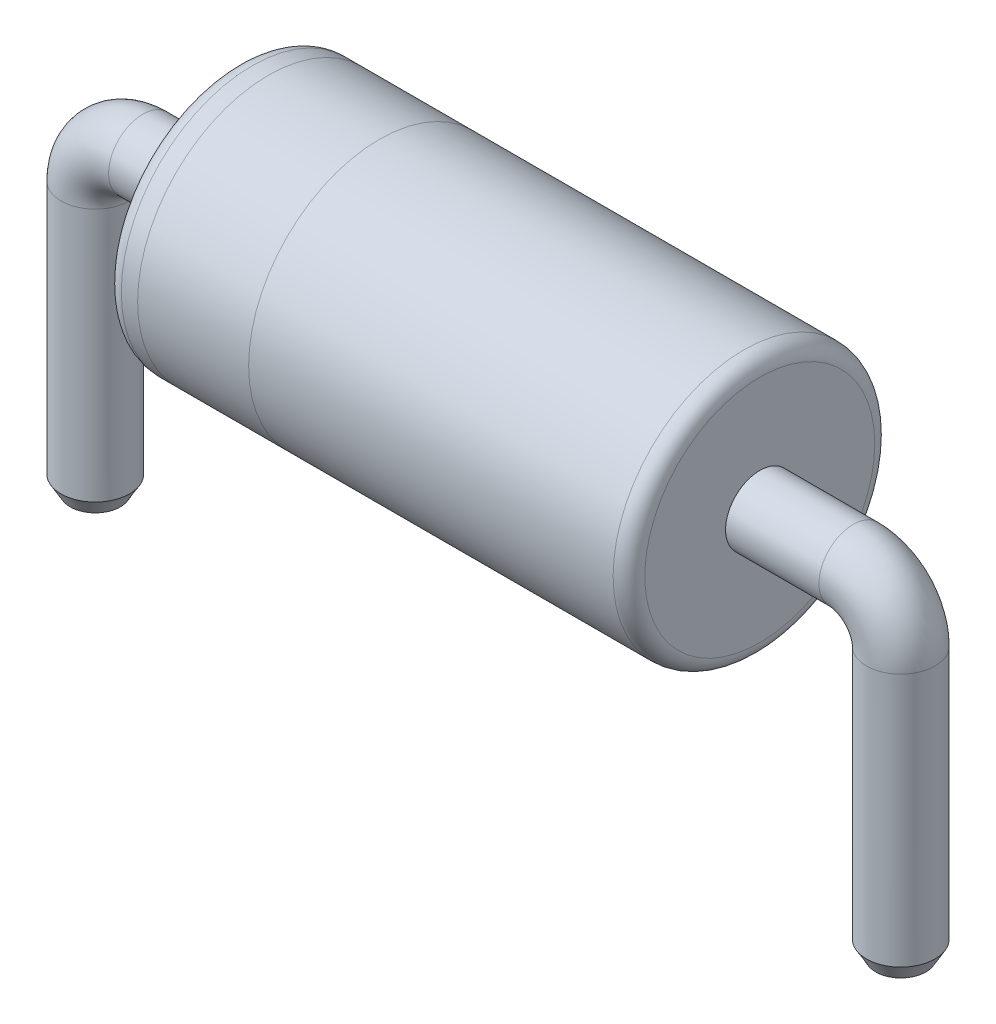
ISO-10303-21;
HEADER;
FILE_DESCRIPTION(('STEP AP214'),'2;1');
FILE_NAME('part.step','',(''),(''),'','','');
FILE_SCHEMA(('AUTOMOTIVE_DESIGN { 1 0 10303 214 1 1 1 1 }'));
ENDSEC;
DATA;
#1=APPLICATION_CONTEXT('core data for automotive mechanical design processes');
#2=APPLICATION_PROTOCOL_DEFINITION('international standard','automotive_design',2000,#1);
#3=PRODUCT_CONTEXT('',#1,'mechanical');
#4=PRODUCT('Part','Part','',(#3));
#5=PRODUCT_RELATED_PRODUCT_CATEGORY('part','',(#4));
#6=PRODUCT_DEFINITION_FORMATION('','',#4);
#7=PRODUCT_DEFINITION_CONTEXT('part definition',#1,'design');
#8=PRODUCT_DEFINITION('design','',#6,#7);
#9=PRODUCT_DEFINITION_SHAPE('','',#8);
#10=(LENGTH_UNIT() NAMED_UNIT(*) SI_UNIT(.MILLI.,.METRE.));
#11=(NAMED_UNIT(*) PLANE_ANGLE_UNIT() SI_UNIT($,.RADIAN.));
#12=(NAMED_UNIT(*) SI_UNIT($,.STERADIAN.) SOLID_ANGLE_UNIT());
#13=UNCERTAINTY_MEASURE_WITH_UNIT(LENGTH_MEASURE(1.E-05),#10,'distance_accuracy_value','');
#14=(GEOMETRIC_REPRESENTATION_CONTEXT(3) GLOBAL_UNCERTAINTY_ASSIGNED_CONTEXT((#13)) GLOBAL_UNIT_ASSIGNED_CONTEXT((#10,
#11,#12)) REPRESENTATION_CONTEXT('',''));
#15=CARTESIAN_POINT('',(0.,0.,0.));
#16=DIRECTION('',(0.,0.,1.));
#17=DIRECTION('',(1.,0.,0.));
#18=AXIS2_PLACEMENT_3D('',#15,#16,#17);
#19=CARTESIAN_POINT('',(-4.191,2.,0.));
#20=DIRECTION('',(1.,0.,0.));
#21=DIRECTION('',(0.,0.,-1.));
#22=AXIS2_PLACEMENT_3D('',#19,#20,#21);
#23=CYLINDRICAL_SURFACE('',#22,0.825);
#24=CARTESIAN_POINT('',(-0.989,2.,0.));
#25=DIRECTION('',(1.,0.,0.));
#26=DIRECTION('',(0.,0.,-1.));
#27=AXIS2_PLACEMENT_3D('',#24,#25,#26);
#28=CIRCLE('',#27,0.825);
#29=CARTESIAN_POINT('',(-0.989,2.,-0.825));
#30=VERTEX_POINT('',#29);
#31=EDGE_CURVE('E72',#30,#30,#28,.F.);
#32=ORIENTED_EDGE('',*,*,#31,.T.);
#33=EDGE_LOOP('',(#32));
#34=FACE_BOUND('',#33,.T.);
#35=CARTESIAN_POINT('',(-3.28786134710373,2.,0.));
#36=DIRECTION('',(-1.,0.,0.));
#37=DIRECTION('',(0.,-1.,0.));
#38=AXIS2_PLACEMENT_3D('',#35,#36,#37);
#39=CIRCLE('',#38,0.825);
#40=CARTESIAN_POINT('',(-3.28786134710373,1.175,0.));
#41=VERTEX_POINT('',#40);
#42=EDGE_CURVE('E10',#41,#41,#39,.F.);
#43=ORIENTED_EDGE('',*,*,#42,.T.);
#44=EDGE_LOOP('',(#43));
#45=FACE_BOUND('',#44,.T.);
#46=ADVANCED_FACE('F31',(#34,#45),#23,.T.);
#47=CARTESIAN_POINT('',(-4.091,2.,0.));
#48=DIRECTION('',(1.,0.,0.));
#49=DIRECTION('',(0.,0.,-1.));
#50=AXIS2_PLACEMENT_3D('',#47,#48,#49);
#51=CIRCLE('',#50,0.825);
#52=CARTESIAN_POINT('',(-4.091,2.,-0.825));
#53=VERTEX_POINT('',#52);
#54=EDGE_CURVE('E69',#53,#53,#51,.T.);
#55=ORIENTED_EDGE('',*,*,#54,.T.);
#56=EDGE_LOOP('',(#55));
#57=FACE_BOUND('',#56,.T.);
#58=CARTESIAN_POINT('',(-3.98786134710373,2.,0.));
#59=DIRECTION('',(1.,0.,0.));
#60=DIRECTION('',(0.,0.,-1.));
#61=AXIS2_PLACEMENT_3D('',#58,#59,#60);
#62=CIRCLE('',#61,0.825);
#63=CARTESIAN_POINT('',(-3.98786134710373,2.,-0.825));
#64=VERTEX_POINT('',#63);
#65=EDGE_CURVE('E39',#64,#64,#62,.F.);
#66=ORIENTED_EDGE('',*,*,#65,.T.);
#67=EDGE_LOOP('',(#66));
#68=FACE_BOUND('',#67,.T.);
#69=ADVANCED_FACE('F112',(#57,#68),#23,.T.);
#70=CARTESIAN_POINT('',(-0.300000000000002,2.,0.));
#71=DIRECTION('',(-1.,0.,0.));
#72=DIRECTION('',(0.,-1.,0.));
#73=AXIS2_PLACEMENT_3D('',#70,#71,#72);
#74=CYLINDRICAL_SURFACE('',#73,0.2159);
#75=CARTESIAN_POINT('',(-4.78,2.,0.));
#76=DIRECTION('',(-1.,0.,0.));
#77=DIRECTION('',(0.,0.,1.));
#78=AXIS2_PLACEMENT_3D('',#75,#76,#77);
#79=CIRCLE('',#78,0.2159);
#80=CARTESIAN_POINT('',(-4.78,2.2159,0.));
#81=VERTEX_POINT('',#80);
#82=EDGE_CURVE('E85',#81,#81,#79,.T.);
#83=ORIENTED_EDGE('',*,*,#82,.F.);
#84=EDGE_LOOP('',(#83));
#85=FACE_BOUND('',#84,.T.);
#86=CARTESIAN_POINT('',(-4.191,2.,0.));
#87=DIRECTION('',(1.,0.,0.));
#88=DIRECTION('',(0.,0.,-1.));
#89=AXIS2_PLACEMENT_3D('',#86,#87,#88);
#90=CIRCLE('',#89,0.2159);
#91=CARTESIAN_POINT('',(-4.191,2.,-0.2159));
#92=VERTEX_POINT('',#91);
#93=EDGE_CURVE('E76',#92,#92,#90,.F.);
#94=ORIENTED_EDGE('',*,*,#93,.T.);
#95=EDGE_LOOP('',(#94));
#96=FACE_BOUND('',#95,.T.);
#97=ADVANCED_FACE('F119',(#85,#96),#74,.T.);
#98=CARTESIAN_POINT('',(-5.08,1.7,0.));
#99=DIRECTION('',(0.,-1.,0.));
#100=DIRECTION('',(0.,0.,-1.));
#101=AXIS2_PLACEMENT_3D('',#98,#99,#100);
#102=CYLINDRICAL_SURFACE('',#101,0.2159);
#103=CARTESIAN_POINT('',(-5.08,0.0999999999999912,0.));
#104=DIRECTION('',(0.,-1.,0.));
#105=DIRECTION('',(0.,0.,-1.));
#106=AXIS2_PLACEMENT_3D('',#103,#104,#105);
#107=CIRCLE('',#106,0.2159);
#108=CARTESIAN_POINT('',(-5.08,0.0999999999999912,-0.2159));
#109=VERTEX_POINT('',#108);
#110=EDGE_CURVE('E57',#109,#109,#107,.F.);
#111=ORIENTED_EDGE('',*,*,#110,.T.);
#112=EDGE_LOOP('',(#111));
#113=FACE_BOUND('',#112,.T.);
#114=CARTESIAN_POINT('',(-5.08,1.7,0.));
#115=DIRECTION('',(0.,-1.,0.));
#116=DIRECTION('',(0.,0.,1.));
#117=AXIS2_PLACEMENT_3D('',#114,#115,#116);
#118=CIRCLE('',#117,0.2159);
#119=CARTESIAN_POINT('',(-5.2959,1.7,0.));
#120=VERTEX_POINT('',#119);
#121=EDGE_CURVE('E82',#120,#120,#118,.T.);
#122=ORIENTED_EDGE('',*,*,#121,.T.);
#123=EDGE_LOOP('',(#122));
#124=FACE_BOUND('',#123,.T.);
#125=ADVANCED_FACE('F139',(#113,#124),#102,.T.);
#126=CARTESIAN_POINT('',(-4.78,1.7,0.));
#127=DIRECTION('',(0.,0.,1.));
#128=DIRECTION('',(1.,0.,0.));
#129=AXIS2_PLACEMENT_3D('',#126,#127,#128);
#130=TOROIDAL_SURFACE('',#129,0.3,0.2159);
#131=CARTESIAN_POINT('',(-4.78,1.7,0.));
#132=DIRECTION('',(0.,0.,1.));
#133=DIRECTION('',(1.,0.,0.));
#134=AXIS2_PLACEMENT_3D('',#131,#132,#133);
#135=CIRCLE('',#134,0.5159);
#136=EDGE_CURVE('',#81,#120,#135,.T.);
#137=ORIENTED_EDGE('',*,*,#82,.T.);
#138=ORIENTED_EDGE('',*,*,#121,.F.);
#139=ORIENTED_EDGE('',*,*,#136,.T.);
#140=ORIENTED_EDGE('',*,*,#136,.F.);
#141=EDGE_LOOP('',(#137,#139,#138,#140));
#142=FACE_BOUND('',#141,.T.);
#143=ADVANCED_FACE('F133',(#142),#130,.T.);
#144=CARTESIAN_POINT('',(-5.08,0.,0.));
#145=DIRECTION('',(0.,-1.,0.));
#146=DIRECTION('',(0.,0.,1.));
#147=AXIS2_PLACEMENT_3D('',#144,#145,#146);
#148=PLANE('',#147);
#149=CARTESIAN_POINT('',(-5.08,0.,0.));
#150=DIRECTION('',(0.,-1.,0.));
#151=DIRECTION('',(1.,0.,0.));
#152=AXIS2_PLACEMENT_3D('',#149,#150,#151);
#153=CIRCLE('',#152,0.158164973081045);
#154=CARTESIAN_POINT('',(-4.92183502691896,0.,0.));
#155=VERTEX_POINT('',#154);
#156=EDGE_CURVE('E60',#155,#155,#153,.T.);
#157=ORIENTED_EDGE('',*,*,#156,.T.);
#158=EDGE_LOOP('',(#157));
#159=FACE_BOUND('',#158,.T.);
#160=ADVANCED_FACE('F125',(#159),#148,.T.);
#161=ORIENTED_EDGE('',*,*,#42,.F.);
#162=EDGE_LOOP('',(#161));
#163=FACE_BOUND('',#162,.T.);
#164=ORIENTED_EDGE('',*,*,#65,.F.);
#165=EDGE_LOOP('',(#164));
#166=FACE_BOUND('',#165,.T.);
#167=ADVANCED_FACE('F115',(#163,#166),#23,.T.);
#168=CARTESIAN_POINT('',(-4.191,2.,0.));
#169=DIRECTION('',(1.,0.,0.));
#170=DIRECTION('',(0.,0.,-1.));
#171=AXIS2_PLACEMENT_3D('',#168,#169,#170);
#172=PLANE('',#171);
#173=CARTESIAN_POINT('',(-4.191,2.,0.));
#174=DIRECTION('',(1.,0.,0.));
#175=DIRECTION('',(0.,0.,-1.));
#176=AXIS2_PLACEMENT_3D('',#173,#174,#175);
#177=CIRCLE('',#176,0.725);
#178=CARTESIAN_POINT('',(-4.191,2.,-0.725));
#179=VERTEX_POINT('',#178);
#180=EDGE_CURVE('E66',#179,#179,#177,.F.);
#181=ORIENTED_EDGE('',*,*,#180,.T.);
#182=EDGE_LOOP('',(#181));
#183=FACE_BOUND('',#182,.T.);
#184=ORIENTED_EDGE('',*,*,#93,.F.);
#185=EDGE_LOOP('',(#184));
#186=FACE_BOUND('',#185,.T.);
#187=ADVANCED_FACE('F124',(#183,#186),#172,.F.);
#188=CARTESIAN_POINT('',(-0.889,2.,0.));
#189=DIRECTION('',(1.,0.,0.));
#190=DIRECTION('',(0.,0.,-1.));
#191=AXIS2_PLACEMENT_3D('',#188,#189,#190);
#192=PLANE('',#191);
#193=CARTESIAN_POINT('',(-0.889,2.,0.));
#194=DIRECTION('',(1.,0.,0.));
#195=DIRECTION('',(0.,0.,-1.));
#196=AXIS2_PLACEMENT_3D('',#193,#194,#195);
#197=CIRCLE('',#196,0.725);
#198=CARTESIAN_POINT('',(-0.889,2.,-0.725));
#199=VERTEX_POINT('',#198);
#200=EDGE_CURVE('E63',#199,#199,#197,.T.);
#201=ORIENTED_EDGE('',*,*,#200,.T.);
#202=EDGE_LOOP('',(#201));
#203=FACE_BOUND('',#202,.T.);
#204=CARTESIAN_POINT('',(-0.889,2.,0.));
#205=DIRECTION('',(1.,0.,0.));
#206=DIRECTION('',(0.,0.,-1.));
#207=AXIS2_PLACEMENT_3D('',#204,#205,#206);
#208=CIRCLE('',#207,0.2159);
#209=CARTESIAN_POINT('',(-0.889,2.,-0.2159));
#210=VERTEX_POINT('',#209);
#211=EDGE_CURVE('E75',#210,#210,#208,.F.);
#212=ORIENTED_EDGE('',*,*,#211,.T.);
#213=EDGE_LOOP('',(#212));
#214=FACE_BOUND('',#213,.T.);
#215=ADVANCED_FACE('F108',(#203,#214),#192,.T.);
#216=CARTESIAN_POINT('',(0.,0.,0.));
#217=DIRECTION('',(0.,1.,0.));
#218=DIRECTION('',(0.,0.,1.));
#219=AXIS2_PLACEMENT_3D('',#216,#217,#218);
#220=PLANE('',#219);
#221=CARTESIAN_POINT('',(0.,0.,0.));
#222=DIRECTION('',(0.,1.,0.));
#223=DIRECTION('',(0.,0.,1.));
#224=AXIS2_PLACEMENT_3D('',#221,#222,#223);
#225=CIRCLE('',#224,0.158164973081037);
#226=CARTESIAN_POINT('',(0.,0.,0.158164973081037));
#227=VERTEX_POINT('',#226);
#228=EDGE_CURVE('E46',#227,#227,#225,.F.);
#229=ORIENTED_EDGE('',*,*,#228,.T.);
#230=EDGE_LOOP('',(#229));
#231=FACE_BOUND('',#230,.T.);
#232=ADVANCED_FACE('F99',(#231),#220,.F.);
#233=CARTESIAN_POINT('',(0.,1.7,0.));
#234=DIRECTION('',(0.,-1.,0.));
#235=DIRECTION('',(0.,0.,-1.));
#236=AXIS2_PLACEMENT_3D('',#233,#234,#235);
#237=CYLINDRICAL_SURFACE('',#236,0.2159);
#238=CARTESIAN_POINT('',(0.,0.1,0.));
#239=DIRECTION('',(0.,1.,0.));
#240=DIRECTION('',(0.,0.,1.));
#241=AXIS2_PLACEMENT_3D('',#238,#239,#240);
#242=CIRCLE('',#241,0.2159);
#243=CARTESIAN_POINT('',(0.,0.1,0.2159));
#244=VERTEX_POINT('',#243);
#245=EDGE_CURVE('E52',#244,#244,#242,.T.);
#246=ORIENTED_EDGE('',*,*,#245,.T.);
#247=EDGE_LOOP('',(#246));
#248=FACE_BOUND('',#247,.T.);
#249=CARTESIAN_POINT('',(0.,1.7,0.));
#250=DIRECTION('',(0.,1.,0.));
#251=DIRECTION('',(0.,0.,1.));
#252=AXIS2_PLACEMENT_3D('',#249,#250,#251);
#253=CIRCLE('',#252,0.2159);
#254=CARTESIAN_POINT('',(0.2159,1.7,0.));
#255=VERTEX_POINT('',#254);
#256=EDGE_CURVE('E79',#255,#255,#253,.T.);
#257=ORIENTED_EDGE('',*,*,#256,.F.);
#258=EDGE_LOOP('',(#257));
#259=FACE_BOUND('',#258,.T.);
#260=ADVANCED_FACE('F97',(#248,#259),#237,.T.);
#261=CARTESIAN_POINT('',(-0.3,1.7,0.));
#262=DIRECTION('',(0.,0.,1.));
#263=DIRECTION('',(1.,0.,0.));
#264=AXIS2_PLACEMENT_3D('',#261,#262,#263);
#265=TOROIDAL_SURFACE('',#264,0.3,0.2159);
#266=CARTESIAN_POINT('',(-0.300000000000002,2.,0.));
#267=DIRECTION('',(-1.,0.,0.));
#268=DIRECTION('',(0.,0.,1.));
#269=AXIS2_PLACEMENT_3D('',#266,#267,#268);
#270=CIRCLE('',#269,0.2159);
#271=CARTESIAN_POINT('',(-0.300000000000004,2.2159,0.));
#272=VERTEX_POINT('',#271);
#273=EDGE_CURVE('E88',#272,#272,#270,.T.);
#274=CARTESIAN_POINT('',(-0.3,1.7,0.));
#275=DIRECTION('',(0.,0.,1.));
#276=DIRECTION('',(1.,0.,0.));
#277=AXIS2_PLACEMENT_3D('',#274,#275,#276);
#278=CIRCLE('',#277,0.5159);
#279=EDGE_CURVE('',#255,#272,#278,.T.);
#280=ORIENTED_EDGE('',*,*,#256,.T.);
#281=ORIENTED_EDGE('',*,*,#273,.F.);
#282=ORIENTED_EDGE('',*,*,#279,.T.);
#283=ORIENTED_EDGE('',*,*,#279,.F.);
#284=EDGE_LOOP('',(#280,#282,#281,#283));
#285=FACE_BOUND('',#284,.T.);
#286=ADVANCED_FACE('F94',(#285),#265,.T.);
#287=ORIENTED_EDGE('',*,*,#211,.F.);
#288=EDGE_LOOP('',(#287));
#289=FACE_BOUND('',#288,.T.);
#290=ORIENTED_EDGE('',*,*,#273,.T.);
#291=EDGE_LOOP('',(#290));
#292=FACE_BOUND('',#291,.T.);
#293=ADVANCED_FACE('F106',(#289,#292),#74,.T.);
#294=CARTESIAN_POINT('',(-4.091,2.,0.));
#295=DIRECTION('',(1.,0.,0.));
#296=DIRECTION('',(0.,0.,-1.));
#297=AXIS2_PLACEMENT_3D('',#294,#295,#296);
#298=TOROIDAL_SURFACE('',#297,0.725,0.1);
#299=ORIENTED_EDGE('',*,*,#180,.F.);
#300=EDGE_LOOP('',(#299));
#301=FACE_BOUND('',#300,.T.);
#302=ORIENTED_EDGE('',*,*,#54,.F.);
#303=EDGE_LOOP('',(#302));
#304=FACE_BOUND('',#303,.T.);
#305=ADVANCED_FACE('F153',(#301,#304),#298,.T.);
#306=CARTESIAN_POINT('',(-0.989,2.,0.));
#307=DIRECTION('',(1.,0.,0.));
#308=DIRECTION('',(0.,0.,-1.));
#309=AXIS2_PLACEMENT_3D('',#306,#307,#308);
#310=TOROIDAL_SURFACE('',#309,0.725,0.1);
#311=ORIENTED_EDGE('',*,*,#31,.F.);
#312=EDGE_LOOP('',(#311));
#313=FACE_BOUND('',#312,.T.);
#314=ORIENTED_EDGE('',*,*,#200,.F.);
#315=EDGE_LOOP('',(#314));
#316=FACE_BOUND('',#315,.T.);
#317=ADVANCED_FACE('F146',(#313,#316),#310,.T.);
#318=CARTESIAN_POINT('',(-5.08,0.,0.));
#319=DIRECTION('',(0.,1.,0.));
#320=DIRECTION('',(0.,0.,1.));
#321=AXIS2_PLACEMENT_3D('',#318,#319,#320);
#322=CONICAL_SURFACE('',#321,0.158164973081045,0.523598775598278);
#323=ORIENTED_EDGE('',*,*,#110,.F.);
#324=EDGE_LOOP('',(#323));
#325=FACE_BOUND('',#324,.T.);
#326=ORIENTED_EDGE('',*,*,#156,.F.);
#327=EDGE_LOOP('',(#326));
#328=FACE_BOUND('',#327,.T.);
#329=ADVANCED_FACE('F144',(#325,#328),#322,.T.);
#330=CARTESIAN_POINT('',(0.,0.1,0.));
#331=DIRECTION('',(0.,1.,0.));
#332=DIRECTION('',(0.,0.,1.));
#333=AXIS2_PLACEMENT_3D('',#330,#331,#332);
#334=CONICAL_SURFACE('',#333,0.2159,0.523598775598297);
#335=ORIENTED_EDGE('',*,*,#228,.F.);
#336=EDGE_LOOP('',(#335));
#337=FACE_BOUND('',#336,.T.);
#338=ORIENTED_EDGE('',*,*,#245,.F.);
#339=EDGE_LOOP('',(#338));
#340=FACE_BOUND('',#339,.T.);
#341=ADVANCED_FACE('F33',(#337,#340),#334,.T.);
#342=CLOSED_SHELL('',(#46,#69,#97,#125,#143,#160,#167,#187,#215,#232,#260,#286,#293,#305,#317,
#329,#341));
#343=MANIFOLD_SOLID_BREP('B2',#342);
#344=ADVANCED_BREP_SHAPE_REPRESENTATION('',(#18,#343),#14);
#345=SHAPE_DEFINITION_REPRESENTATION(#9,#344);
ENDSEC;
END-ISO-10303-21;
